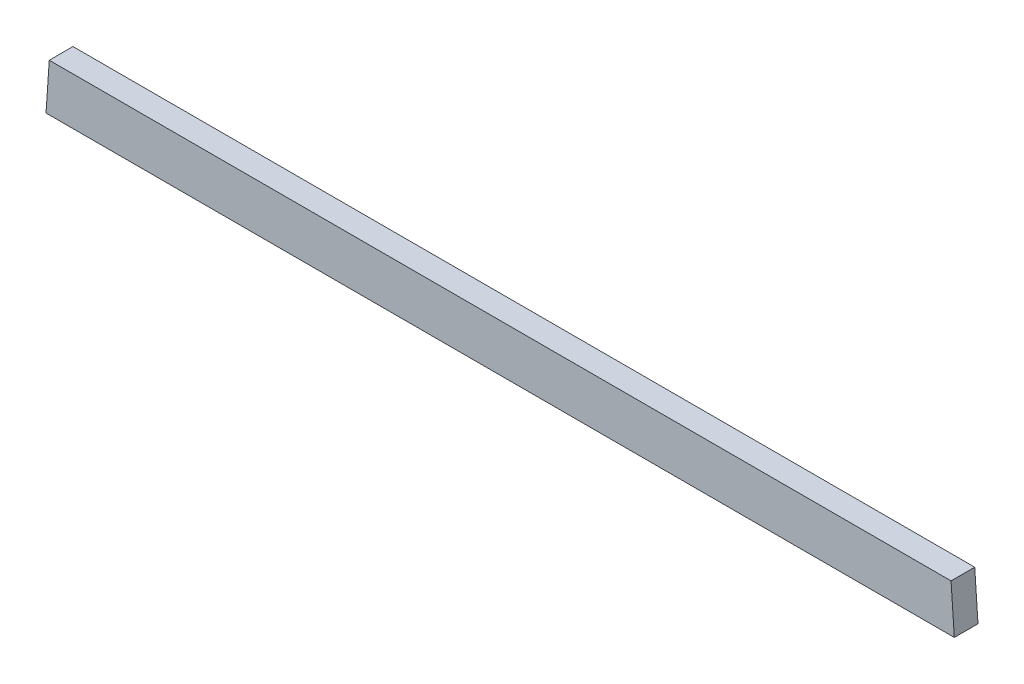
ISO-10303-21;
HEADER;
FILE_DESCRIPTION(('STEP AP214'),'2;1');
FILE_NAME('part.step','',(''),(''),'','','');
FILE_SCHEMA(('AUTOMOTIVE_DESIGN { 1 0 10303 214 1 1 1 1 }'));
ENDSEC;
DATA;
#1=APPLICATION_CONTEXT('core data for automotive mechanical design processes');
#2=APPLICATION_PROTOCOL_DEFINITION('international standard','automotive_design',2000,#1);
#3=PRODUCT_CONTEXT('',#1,'mechanical');
#4=PRODUCT('Part','Part','',(#3));
#5=PRODUCT_RELATED_PRODUCT_CATEGORY('part','',(#4));
#6=PRODUCT_DEFINITION_FORMATION('','',#4);
#7=PRODUCT_DEFINITION_CONTEXT('part definition',#1,'design');
#8=PRODUCT_DEFINITION('design','',#6,#7);
#9=PRODUCT_DEFINITION_SHAPE('','',#8);
#10=(LENGTH_UNIT() NAMED_UNIT(*) SI_UNIT(.MILLI.,.METRE.));
#11=(NAMED_UNIT(*) PLANE_ANGLE_UNIT() SI_UNIT($,.RADIAN.));
#12=(NAMED_UNIT(*) SI_UNIT($,.STERADIAN.) SOLID_ANGLE_UNIT());
#13=UNCERTAINTY_MEASURE_WITH_UNIT(LENGTH_MEASURE(1.E-05),#10,'distance_accuracy_value','');
#14=(GEOMETRIC_REPRESENTATION_CONTEXT(3) GLOBAL_UNCERTAINTY_ASSIGNED_CONTEXT((#13)) GLOBAL_UNIT_ASSIGNED_CONTEXT((#10,
#11,#12)) REPRESENTATION_CONTEXT('',''));
#15=CARTESIAN_POINT('',(0.,0.,0.));
#16=DIRECTION('',(0.,0.,1.));
#17=DIRECTION('',(1.,0.,0.));
#18=AXIS2_PLACEMENT_3D('',#15,#16,#17);
#19=CARTESIAN_POINT('',(-362.606896551718,19.05,19.05));
#20=DIRECTION('',(0.997630328422984,-0.0688020916153656,0.));
#21=DIRECTION('',(0.0688020916153656,0.997630328422984,0.));
#22=AXIS2_PLACEMENT_3D('',#19,#20,#21);
#23=PLANE('',#22);
#24=DIRECTION('',(-0.0688020916153656,-0.997630328422984,0.));
#25=VECTOR('',#24,1.);
#26=CARTESIAN_POINT('',(-362.606896551718,19.05,0.));
#27=LINE('',#26,#25);
#28=CARTESIAN_POINT('',(-362.606896551718,19.05,0.));
#29=VERTEX_POINT('',#28);
#30=CARTESIAN_POINT('',(-365.234482758614,-19.05,0.));
#31=VERTEX_POINT('',#30);
#32=EDGE_CURVE('E96',#29,#31,#27,.T.);
#33=ORIENTED_EDGE('',*,*,#32,.T.);
#34=DIRECTION('',(0.,0.,-1.));
#35=VECTOR('',#34,1.);
#36=CARTESIAN_POINT('',(-365.234482758614,-19.05,19.05));
#37=LINE('',#36,#35);
#38=CARTESIAN_POINT('',(-365.234482758614,-19.05,19.05));
#39=VERTEX_POINT('',#38);
#40=EDGE_CURVE('E11',#39,#31,#37,.T.);
#41=ORIENTED_EDGE('',*,*,#40,.F.);
#42=DIRECTION('',(-0.0688020916153656,-0.997630328422984,0.));
#43=VECTOR('',#42,1.);
#44=CARTESIAN_POINT('',(-362.606896551718,19.05,19.05));
#45=LINE('',#44,#43);
#46=CARTESIAN_POINT('',(-362.606896551718,19.05,19.05));
#47=VERTEX_POINT('',#46);
#48=EDGE_CURVE('E84',#47,#39,#45,.T.);
#49=ORIENTED_EDGE('',*,*,#48,.F.);
#50=DIRECTION('',(0.,0.,-1.));
#51=VECTOR('',#50,1.);
#52=CARTESIAN_POINT('',(-362.606896551718,19.05,19.05));
#53=LINE('',#52,#51);
#54=EDGE_CURVE('E92',#47,#29,#53,.T.);
#55=ORIENTED_EDGE('',*,*,#54,.T.);
#56=EDGE_LOOP('',(#33,#41,#49,#55));
#57=FACE_BOUND('',#56,.T.);
#58=ADVANCED_FACE('F33',(#57),#23,.F.);
#59=CARTESIAN_POINT('',(-365.234482758614,-19.05,19.05));
#60=DIRECTION('',(0.,1.,0.));
#61=DIRECTION('',(0.,0.,1.));
#62=AXIS2_PLACEMENT_3D('',#59,#60,#61);
#63=PLANE('',#62);
#64=DIRECTION('',(1.,0.,0.));
#65=VECTOR('',#64,1.);
#66=CARTESIAN_POINT('',(-365.234482758614,-19.05,0.));
#67=LINE('',#66,#65);
#68=CARTESIAN_POINT('',(365.234482758614,-19.05,0.));
#69=VERTEX_POINT('',#68);
#70=EDGE_CURVE('E88',#31,#69,#67,.T.);
#71=ORIENTED_EDGE('',*,*,#70,.T.);
#72=DIRECTION('',(0.,0.,-1.));
#73=VECTOR('',#72,1.);
#74=CARTESIAN_POINT('',(365.234482758614,-19.05,19.05));
#75=LINE('',#74,#73);
#76=CARTESIAN_POINT('',(365.234482758614,-19.05,19.05));
#77=VERTEX_POINT('',#76);
#78=EDGE_CURVE('E41',#77,#69,#75,.T.);
#79=ORIENTED_EDGE('',*,*,#78,.F.);
#80=DIRECTION('',(1.,0.,0.));
#81=VECTOR('',#80,1.);
#82=CARTESIAN_POINT('',(-365.234482758614,-19.05,19.05));
#83=LINE('',#82,#81);
#84=EDGE_CURVE('E79',#39,#77,#83,.T.);
#85=ORIENTED_EDGE('',*,*,#84,.F.);
#86=ORIENTED_EDGE('',*,*,#40,.T.);
#87=EDGE_LOOP('',(#71,#79,#85,#86));
#88=FACE_BOUND('',#87,.T.);
#89=ADVANCED_FACE('F87',(#88),#63,.F.);
#90=CARTESIAN_POINT('',(362.606896551718,19.05,19.05));
#91=DIRECTION('',(-0.997630328422984,-0.0688020916153656,0.));
#92=DIRECTION('',(0.0688020916153656,-0.997630328422984,0.));
#93=AXIS2_PLACEMENT_3D('',#90,#91,#92);
#94=PLANE('',#93);
#95=DIRECTION('',(-0.0688020916153656,0.997630328422984,0.));
#96=VECTOR('',#95,1.);
#97=CARTESIAN_POINT('',(362.606896551718,19.05,0.));
#98=LINE('',#97,#96);
#99=CARTESIAN_POINT('',(362.606896551718,19.05,0.));
#100=VERTEX_POINT('',#99);
#101=EDGE_CURVE('E66',#69,#100,#98,.T.);
#102=ORIENTED_EDGE('',*,*,#101,.T.);
#103=DIRECTION('',(0.,0.,-1.));
#104=VECTOR('',#103,1.);
#105=CARTESIAN_POINT('',(362.606896551718,19.05,19.05));
#106=LINE('',#105,#104);
#107=CARTESIAN_POINT('',(362.606896551718,19.05,19.05));
#108=VERTEX_POINT('',#107);
#109=EDGE_CURVE('E89',#108,#100,#106,.T.);
#110=ORIENTED_EDGE('',*,*,#109,.F.);
#111=DIRECTION('',(-0.0688020916153656,0.997630328422984,0.));
#112=VECTOR('',#111,1.);
#113=CARTESIAN_POINT('',(362.606896551718,19.05,19.05));
#114=LINE('',#113,#112);
#115=EDGE_CURVE('E82',#77,#108,#114,.T.);
#116=ORIENTED_EDGE('',*,*,#115,.F.);
#117=ORIENTED_EDGE('',*,*,#78,.T.);
#118=EDGE_LOOP('',(#102,#110,#116,#117));
#119=FACE_BOUND('',#118,.T.);
#120=ADVANCED_FACE('F90',(#119),#94,.F.);
#121=CARTESIAN_POINT('',(-362.606896551718,19.05,19.05));
#122=DIRECTION('',(0.,-1.,0.));
#123=DIRECTION('',(0.,0.,-1.));
#124=AXIS2_PLACEMENT_3D('',#121,#122,#123);
#125=PLANE('',#124);
#126=DIRECTION('',(-1.,0.,0.));
#127=VECTOR('',#126,1.);
#128=CARTESIAN_POINT('',(-362.606896551718,19.05,0.));
#129=LINE('',#128,#127);
#130=EDGE_CURVE('E72',#100,#29,#129,.T.);
#131=ORIENTED_EDGE('',*,*,#130,.T.);
#132=ORIENTED_EDGE('',*,*,#54,.F.);
#133=DIRECTION('',(-1.,0.,0.));
#134=VECTOR('',#133,1.);
#135=CARTESIAN_POINT('',(-362.606896551718,19.05,19.05));
#136=LINE('',#135,#134);
#137=EDGE_CURVE('E49',#108,#47,#136,.T.);
#138=ORIENTED_EDGE('',*,*,#137,.F.);
#139=ORIENTED_EDGE('',*,*,#109,.T.);
#140=EDGE_LOOP('',(#131,#132,#138,#139));
#141=FACE_BOUND('',#140,.T.);
#142=ADVANCED_FACE('F103',(#141),#125,.F.);
#143=CARTESIAN_POINT('',(0.,0.,19.05));
#144=DIRECTION('',(0.,0.,1.));
#145=DIRECTION('',(1.,0.,0.));
#146=AXIS2_PLACEMENT_3D('',#143,#144,#145);
#147=PLANE('',#146);
#148=ORIENTED_EDGE('',*,*,#48,.T.);
#149=ORIENTED_EDGE('',*,*,#84,.T.);
#150=ORIENTED_EDGE('',*,*,#115,.T.);
#151=ORIENTED_EDGE('',*,*,#137,.T.);
#152=EDGE_LOOP('',(#148,#149,#150,#151));
#153=FACE_BOUND('',#152,.T.);
#154=ADVANCED_FACE('F80',(#153),#147,.T.);
#155=CARTESIAN_POINT('',(0.,0.,0.));
#156=DIRECTION('',(0.,0.,1.));
#157=DIRECTION('',(1.,0.,0.));
#158=AXIS2_PLACEMENT_3D('',#155,#156,#157);
#159=PLANE('',#158);
#160=ORIENTED_EDGE('',*,*,#32,.F.);
#161=ORIENTED_EDGE('',*,*,#130,.F.);
#162=ORIENTED_EDGE('',*,*,#101,.F.);
#163=ORIENTED_EDGE('',*,*,#70,.F.);
#164=EDGE_LOOP('',(#160,#161,#162,#163));
#165=FACE_BOUND('',#164,.T.);
#166=ADVANCED_FACE('F106',(#165),#159,.F.);
#167=CLOSED_SHELL('',(#58,#89,#120,#142,#154,#166));
#168=MANIFOLD_SOLID_BREP('B2',#167);
#169=ADVANCED_BREP_SHAPE_REPRESENTATION('',(#18,#168),#14);
#170=SHAPE_DEFINITION_REPRESENTATION(#9,#169);
ENDSEC;
END-ISO-10303-21;
